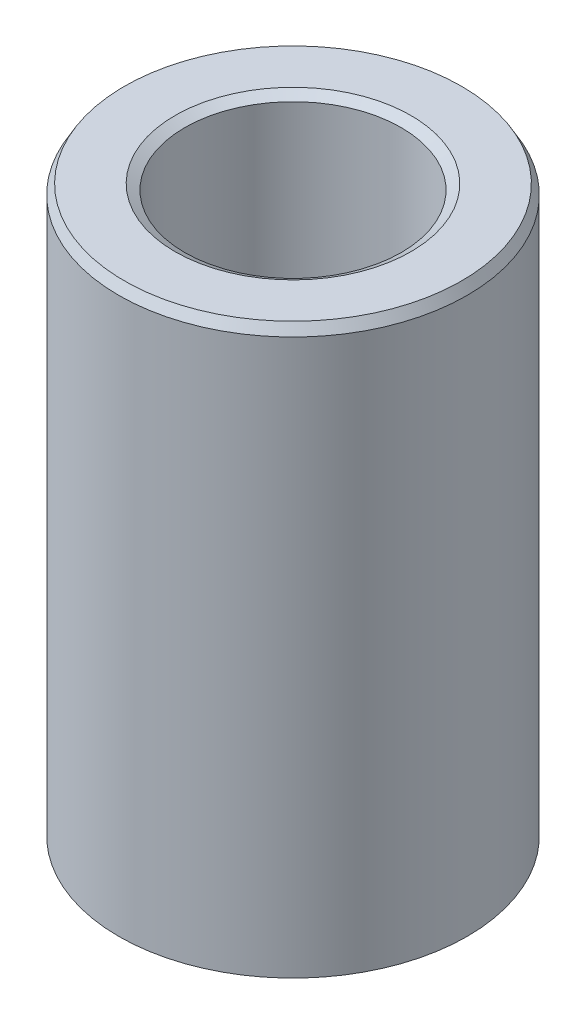
ISO-10303-21;
HEADER;
FILE_DESCRIPTION(('STEP AP214'),'2;1');
FILE_NAME('part.step','',(''),(''),'','','');
FILE_SCHEMA(('AUTOMOTIVE_DESIGN { 1 0 10303 214 1 1 1 1 }'));
ENDSEC;
DATA;
#1=APPLICATION_CONTEXT('core data for automotive mechanical design processes');
#2=APPLICATION_PROTOCOL_DEFINITION('international standard','automotive_design',2000,#1);
#3=PRODUCT_CONTEXT('',#1,'mechanical');
#4=PRODUCT('Part','Part','',(#3));
#5=PRODUCT_RELATED_PRODUCT_CATEGORY('part','',(#4));
#6=PRODUCT_DEFINITION_FORMATION('','',#4);
#7=PRODUCT_DEFINITION_CONTEXT('part definition',#1,'design');
#8=PRODUCT_DEFINITION('design','',#6,#7);
#9=PRODUCT_DEFINITION_SHAPE('','',#8);
#10=(LENGTH_UNIT() NAMED_UNIT(*) SI_UNIT(.MILLI.,.METRE.));
#11=(NAMED_UNIT(*) PLANE_ANGLE_UNIT() SI_UNIT($,.RADIAN.));
#12=(NAMED_UNIT(*) SI_UNIT($,.STERADIAN.) SOLID_ANGLE_UNIT());
#13=UNCERTAINTY_MEASURE_WITH_UNIT(LENGTH_MEASURE(1.E-05),#10,'distance_accuracy_value','');
#14=(GEOMETRIC_REPRESENTATION_CONTEXT(3) GLOBAL_UNCERTAINTY_ASSIGNED_CONTEXT((#13)) GLOBAL_UNIT_ASSIGNED_CONTEXT((#10,
#11,#12)) REPRESENTATION_CONTEXT('',''));
#15=CARTESIAN_POINT('',(0.,0.,0.));
#16=DIRECTION('',(0.,0.,1.));
#17=DIRECTION('',(1.,0.,0.));
#18=AXIS2_PLACEMENT_3D('',#15,#16,#17);
#19=CARTESIAN_POINT('',(0.,73.6859541370206,0.));
#20=DIRECTION('',(0.,-1.,0.));
#21=DIRECTION('',(0.,0.,-1.));
#22=AXIS2_PLACEMENT_3D('',#19,#20,#21);
#23=CYLINDRICAL_SURFACE('',#22,22.5);
#24=CARTESIAN_POINT('',(0.,0.725080795230634,0.));
#25=DIRECTION('',(0.,1.,0.));
#26=DIRECTION('',(0.,0.,1.));
#27=AXIS2_PLACEMENT_3D('',#24,#25,#26);
#28=CIRCLE('',#27,22.5);
#29=CARTESIAN_POINT('',(0.,0.725080795230634,22.5));
#30=VERTEX_POINT('',#29);
#31=EDGE_CURVE('E10',#30,#30,#28,.T.);
#32=ORIENTED_EDGE('',*,*,#31,.T.);
#33=EDGE_LOOP('',(#32));
#34=FACE_BOUND('',#33,.T.);
#35=CARTESIAN_POINT('',(0.,72.4300773600887,0.));
#36=DIRECTION('',(0.,1.,0.));
#37=DIRECTION('',(0.,0.,1.));
#38=AXIS2_PLACEMENT_3D('',#35,#36,#37);
#39=CIRCLE('',#38,22.5);
#40=CARTESIAN_POINT('',(0.,72.4300773600886,-22.5));
#41=VERTEX_POINT('',#40);
#42=EDGE_CURVE('E50',#41,#41,#39,.F.);
#43=ORIENTED_EDGE('',*,*,#42,.T.);
#44=EDGE_LOOP('',(#43));
#45=FACE_BOUND('',#44,.T.);
#46=ADVANCED_FACE('F39',(#34,#45),#23,.T.);
#47=CARTESIAN_POINT('',(0.,73.6859541370206,0.));
#48=DIRECTION('',(0.,1.,0.));
#49=DIRECTION('',(0.,0.,1.));
#50=AXIS2_PLACEMENT_3D('',#47,#48,#49);
#51=PLANE('',#50);
#52=CARTESIAN_POINT('',(0.,73.6859541370206,0.));
#53=DIRECTION('',(0.,1.,0.));
#54=DIRECTION('',(0.,0.,1.));
#55=AXIS2_PLACEMENT_3D('',#52,#53,#54);
#56=CIRCLE('',#55,15.2375210114344);
#57=CARTESIAN_POINT('',(0.,73.6859541370206,15.2375210114344));
#58=VERTEX_POINT('',#57);
#59=EDGE_CURVE('E58',#58,#58,#56,.F.);
#60=ORIENTED_EDGE('',*,*,#59,.T.);
#61=EDGE_LOOP('',(#60));
#62=FACE_BOUND('',#61,.T.);
#63=CARTESIAN_POINT('',(0.,73.6859541370206,0.));
#64=DIRECTION('',(0.,1.,0.));
#65=DIRECTION('',(0.,0.,1.));
#66=AXIS2_PLACEMENT_3D('',#63,#64,#65);
#67=CIRCLE('',#66,21.7749192047693);
#68=CARTESIAN_POINT('',(0.,73.6859541370206,-21.7749192047693));
#69=VERTEX_POINT('',#68);
#70=EDGE_CURVE('E61',#69,#69,#67,.T.);
#71=ORIENTED_EDGE('',*,*,#70,.T.);
#72=EDGE_LOOP('',(#71));
#73=FACE_BOUND('',#72,.T.);
#74=ADVANCED_FACE('F88',(#62,#73),#51,.T.);
#75=CARTESIAN_POINT('',(0.,0.,0.));
#76=DIRECTION('',(0.,1.,0.));
#77=DIRECTION('',(0.,0.,1.));
#78=AXIS2_PLACEMENT_3D('',#75,#76,#77);
#79=PLANE('',#78);
#80=CARTESIAN_POINT('',(0.,0.,0.));
#81=DIRECTION('',(0.,1.,0.));
#82=DIRECTION('',(0.,0.,1.));
#83=AXIS2_PLACEMENT_3D('',#80,#81,#82);
#84=CIRCLE('',#83,14.7067250297331);
#85=CARTESIAN_POINT('',(0.,0.,-14.7067250297331));
#86=VERTEX_POINT('',#85);
#87=EDGE_CURVE('E51',#86,#86,#84,.T.);
#88=ORIENTED_EDGE('',*,*,#87,.T.);
#89=EDGE_LOOP('',(#88));
#90=FACE_BOUND('',#89,.T.);
#91=CARTESIAN_POINT('',(0.,0.,0.));
#92=DIRECTION('',(0.,1.,0.));
#93=DIRECTION('',(0.,0.,1.));
#94=AXIS2_PLACEMENT_3D('',#91,#92,#93);
#95=CIRCLE('',#94,21.2441232230681);
#96=CARTESIAN_POINT('',(0.,0.,21.2441232230681));
#97=VERTEX_POINT('',#96);
#98=EDGE_CURVE('E54',#97,#97,#95,.F.);
#99=ORIENTED_EDGE('',*,*,#98,.T.);
#100=EDGE_LOOP('',(#99));
#101=FACE_BOUND('',#100,.T.);
#102=ADVANCED_FACE('F83',(#90,#101),#79,.F.);
#103=CARTESIAN_POINT('',(0.,73.6859541370206,0.));
#104=DIRECTION('',(0.,-1.,0.));
#105=DIRECTION('',(0.,0.,-1.));
#106=AXIS2_PLACEMENT_3D('',#103,#104,#105);
#107=CYLINDRICAL_SURFACE('',#106,13.9816442345025);
#108=CARTESIAN_POINT('',(0.,72.9608733417899,0.));
#109=DIRECTION('',(0.,1.,0.));
#110=DIRECTION('',(0.,0.,1.));
#111=AXIS2_PLACEMENT_3D('',#108,#109,#110);
#112=CIRCLE('',#111,13.9816442345025);
#113=CARTESIAN_POINT('',(0.,72.9608733417899,13.9816442345025));
#114=VERTEX_POINT('',#113);
#115=EDGE_CURVE('E67',#114,#114,#112,.T.);
#116=ORIENTED_EDGE('',*,*,#115,.T.);
#117=EDGE_LOOP('',(#116));
#118=FACE_BOUND('',#117,.T.);
#119=CARTESIAN_POINT('',(0.,1.25587677693194,0.));
#120=DIRECTION('',(0.,1.,0.));
#121=DIRECTION('',(0.,0.,1.));
#122=AXIS2_PLACEMENT_3D('',#119,#120,#121);
#123=CIRCLE('',#122,13.9816442345025);
#124=CARTESIAN_POINT('',(0.,1.25587677693194,-13.9816442345025));
#125=VERTEX_POINT('',#124);
#126=EDGE_CURVE('E69',#125,#125,#123,.F.);
#127=ORIENTED_EDGE('',*,*,#126,.T.);
#128=EDGE_LOOP('',(#127));
#129=FACE_BOUND('',#128,.T.);
#130=ADVANCED_FACE('F71',(#118,#129),#107,.F.);
#131=CARTESIAN_POINT('',(0.,72.9608733417899,0.));
#132=DIRECTION('',(0.,1.,0.));
#133=DIRECTION('',(0.,0.,1.));
#134=AXIS2_PLACEMENT_3D('',#131,#132,#133);
#135=CONICAL_SURFACE('',#134,13.9816442345025,1.0471975511966);
#136=ORIENTED_EDGE('',*,*,#59,.F.);
#137=EDGE_LOOP('',(#136));
#138=FACE_BOUND('',#137,.T.);
#139=ORIENTED_EDGE('',*,*,#115,.F.);
#140=EDGE_LOOP('',(#139));
#141=FACE_BOUND('',#140,.T.);
#142=ADVANCED_FACE('F77',(#138,#141),#135,.F.);
#143=CARTESIAN_POINT('',(0.,0.,0.));
#144=DIRECTION('',(0.,-1.,0.));
#145=DIRECTION('',(0.,0.,-1.));
#146=AXIS2_PLACEMENT_3D('',#143,#144,#145);
#147=CONICAL_SURFACE('',#146,14.7067250297331,0.523598775598295);
#148=CARTESIAN_POINT('',(0.,1.25587677693194,-13.9816442345025));
#149=CARTESIAN_POINT('',(0.,1.24279472717223,-13.9891971594528));
#150=CARTESIAN_POINT('',(0.,1.22971267741252,-13.9967500844031));
#151=CARTESIAN_POINT('',(0.,1.20354857789311,-14.0118559343037));
#152=CARTESIAN_POINT('',(0.,1.1904665281334,-14.019408859254));
#153=CARTESIAN_POINT('',(0.,1.16430242861398,-14.0345147091547));
#154=CARTESIAN_POINT('',(0.,1.15122037885428,-14.042067634105));
#155=CARTESIAN_POINT('',(0.,1.12505627933486,-14.0571734840056));
#156=CARTESIAN_POINT('',(0.,1.11197422957515,-14.064726408956));
#157=CARTESIAN_POINT('',(0.,1.08581013005574,-14.0798322588566));
#158=CARTESIAN_POINT('',(0.,1.07272808029603,-14.0873851838069));
#159=CARTESIAN_POINT('',(0.,1.04656398077662,-14.1024910337076));
#160=CARTESIAN_POINT('',(0.,1.03348193101691,-14.1100439586579));
#161=CARTESIAN_POINT('',(0.,1.00731783149749,-14.1251498085585));
#162=CARTESIAN_POINT('',(0.,0.994235781737784,-14.1327027335088));
#163=CARTESIAN_POINT('',(0.,0.968071682218369,-14.1478085834095));
#164=CARTESIAN_POINT('',(0.,0.954989632458661,-14.1553615083598));
#165=CARTESIAN_POINT('',(0.,0.928825532939246,-14.1704673582604));
#166=CARTESIAN_POINT('',(0.,0.915743483179538,-14.1780202832108));
#167=CARTESIAN_POINT('',(0.,0.889579383660123,-14.1931261331114));
#168=CARTESIAN_POINT('',(0.,0.876497333900415,-14.2006790580617));
#169=CARTESIAN_POINT('',(0.,0.850333234381,-14.2157849079623));
#170=CARTESIAN_POINT('',(0.,0.837251184621292,-14.2233378329127));
#171=CARTESIAN_POINT('',(0.,0.811087085101877,-14.2384436828133));
#172=CARTESIAN_POINT('',(0.,0.798005035342169,-14.2459966077636));
#173=CARTESIAN_POINT('',(0.,0.771840935822754,-14.2611024576643));
#174=CARTESIAN_POINT('',(0.,0.758758886063046,-14.2686553826146));
#175=CARTESIAN_POINT('',(0.,0.732594786543631,-14.2837612325152));
#176=CARTESIAN_POINT('',(0.,0.719512736783923,-14.2913141574655));
#177=CARTESIAN_POINT('',(0.,0.693348637264508,-14.3064200073662));
#178=CARTESIAN_POINT('',(0.,0.6802665875048,-14.3139729323165));
#179=CARTESIAN_POINT('',(0.,0.654102487985385,-14.3290787822171));
#180=CARTESIAN_POINT('',(0.,0.641020438225677,-14.3366317071675));
#181=CARTESIAN_POINT('',(0.,0.614856338706261,-14.3517375570681));
#182=CARTESIAN_POINT('',(0.,0.601774288946554,-14.3592904820184));
#183=CARTESIAN_POINT('',(0.,0.575610189427138,-14.3743963319191));
#184=CARTESIAN_POINT('',(0.,0.562528139667431,-14.3819492568694));
#185=CARTESIAN_POINT('',(0.,0.536364040148015,-14.39705510677));
#186=CARTESIAN_POINT('',(0.,0.523281990388308,-14.4046080317203));
#187=CARTESIAN_POINT('',(0.,0.497117890868892,-14.419713881621));
#188=CARTESIAN_POINT('',(0.,0.484035841109185,-14.4272668065713));
#189=CARTESIAN_POINT('',(0.,0.457871741589769,-14.4423726564719));
#190=CARTESIAN_POINT('',(0.,0.444789691830061,-14.4499255814222));
#191=CARTESIAN_POINT('',(0.,0.418625592310646,-14.4650314313229));
#192=CARTESIAN_POINT('',(0.,0.405543542550938,-14.4725843562732));
#193=CARTESIAN_POINT('',(0.,0.379379443031523,-14.4876902061738));
#194=CARTESIAN_POINT('',(0.,0.366297393271815,-14.4952431311242));
#195=CARTESIAN_POINT('',(0.,0.3401332937524,-14.5103489810248));
#196=CARTESIAN_POINT('',(0.,0.327051243992692,-14.5179019059751));
#197=CARTESIAN_POINT('',(0.,0.300887144473277,-14.5330077558758));
#198=CARTESIAN_POINT('',(0.,0.287805094713569,-14.5405606808261));
#199=CARTESIAN_POINT('',(0.,0.261640995194154,-14.5556665307267));
#200=CARTESIAN_POINT('',(0.,0.248558945434446,-14.563219455677));
#201=CARTESIAN_POINT('',(0.,0.222394845915031,-14.5783253055777));
#202=CARTESIAN_POINT('',(0.,0.209312796155323,-14.585878230528));
#203=CARTESIAN_POINT('',(0.,0.183148696635908,-14.6009840804286));
#204=CARTESIAN_POINT('',(0.,0.1700666468762,-14.608537005379));
#205=CARTESIAN_POINT('',(0.,0.143902547356785,-14.6236428552796));
#206=CARTESIAN_POINT('',(0.,0.130820497597077,-14.6311957802299));
#207=CARTESIAN_POINT('',(0.,0.104656398077662,-14.6463016301305));
#208=CARTESIAN_POINT('',(0.,0.0915743483179538,-14.6538545550809));
#209=CARTESIAN_POINT('',(0.,0.0654102487985384,-14.6689604049815));
#210=CARTESIAN_POINT('',(0.,0.0523281990388308,-14.6765133299318));
#211=CARTESIAN_POINT('',(0.,0.0261640995194154,-14.6916191798325));
#212=CARTESIAN_POINT('',(0.,0.0130820497597077,-14.6991721047828));
#213=CARTESIAN_POINT('',(0.,0.,-14.7067250297331));
#214=B_SPLINE_CURVE_WITH_KNOTS('',3,(#148,#149,#150,#151,#152,#153,#154,#155,#156,#157,#158,
#159,#160,#161,#162,#163,#164,#165,#166,#167,#168,#169,#170,#171,#172,#173,#174,#175,#176,#177,
#178,#179,#180,#181,#182,#183,#184,#185,#186,#187,#188,#189,#190,#191,#192,#193,#194,#195,#196,
#197,#198,#199,#200,#201,#202,#203,#204,#205,#206,#207,#208,#209,#210,#211,#212,#213),
.UNSPECIFIED.,.F.,.F.,(4,2,2,2,2,2,2,2,2,2,2,2,2,2,2,2,2,2,2,2,2,2,2,2,2,2,2,2,2,2,2,2,4),(0.,
0.0453175497019158,0.0906350994038316,0.135952649105747,0.181270198807663,0.226587748509579,
0.271905298211495,0.317222847913411,0.362540397615326,0.407857947317242,0.453175497019158,
0.498493046721074,0.543810596422989,0.589128146124905,0.634445695826821,0.679763245528737,
0.725080795230653,0.770398344932569,0.815715894634484,0.8610334443364,0.906350994038316,
0.951668543740232,0.996986093442148,1.04230364314406,1.08762119284598,1.13293874254789,
1.17825629224981,1.22357384195173,1.26889139165364,1.31420894135556,1.35952649105747,
1.40484404075939,1.4501615904613),.UNSPECIFIED.);
#215=EDGE_CURVE('BSEAM73',#125,#86,#214,.T.);
#216=ORIENTED_EDGE('',*,*,#126,.F.);
#217=ORIENTED_EDGE('',*,*,#87,.F.);
#218=ORIENTED_EDGE('',*,*,#215,.T.);
#219=ORIENTED_EDGE('',*,*,#215,.F.);
#220=EDGE_LOOP('',(#216,#218,#217,#219));
#221=FACE_BOUND('',#220,.T.);
#222=ADVANCED_FACE('F73',(#221),#147,.F.);
#223=CARTESIAN_POINT('',(0.,0.725080795230634,0.));
#224=DIRECTION('',(0.,1.,0.));
#225=DIRECTION('',(0.,0.,1.));
#226=AXIS2_PLACEMENT_3D('',#223,#224,#225);
#227=CONICAL_SURFACE('',#226,22.5,1.0471975511966);
#228=ORIENTED_EDGE('',*,*,#98,.F.);
#229=EDGE_LOOP('',(#228));
#230=FACE_BOUND('',#229,.T.);
#231=ORIENTED_EDGE('',*,*,#31,.F.);
#232=EDGE_LOOP('',(#231));
#233=FACE_BOUND('',#232,.T.);
#234=ADVANCED_FACE('F76',(#230,#233),#227,.T.);
#235=CARTESIAN_POINT('',(0.,73.6859541370206,0.));
#236=DIRECTION('',(0.,-1.,0.));
#237=DIRECTION('',(0.,0.,-1.));
#238=AXIS2_PLACEMENT_3D('',#235,#236,#237);
#239=CONICAL_SURFACE('',#238,21.7749192047693,0.523598775598301);
#240=CARTESIAN_POINT('',(0.,72.4300773600886,-22.5));
#241=CARTESIAN_POINT('',(0.,72.4431594098484,-22.4924470750497));
#242=CARTESIAN_POINT('',(0.,72.4562414596081,-22.4848941500994));
#243=CARTESIAN_POINT('',(0.,72.4824055591275,-22.4697883001987));
#244=CARTESIAN_POINT('',(0.,72.4954876088872,-22.4622353752484));
#245=CARTESIAN_POINT('',(0.,72.5216517084066,-22.4471295253478));
#246=CARTESIAN_POINT('',(0.,72.5347337581663,-22.4395766003975));
#247=CARTESIAN_POINT('',(0.,72.5608978576857,-22.4244707504968));
#248=CARTESIAN_POINT('',(0.,72.5739799074454,-22.4169178255465));
#249=CARTESIAN_POINT('',(0.,72.6001440069649,-22.4018119756459));
#250=CARTESIAN_POINT('',(0.,72.6132260567246,-22.3942590506955));
#251=CARTESIAN_POINT('',(0.,72.639390156244,-22.3791532007949));
#252=CARTESIAN_POINT('',(0.,72.6524722060037,-22.3716002758446));
#253=CARTESIAN_POINT('',(0.,72.6786363055231,-22.3564944259439));
#254=CARTESIAN_POINT('',(0.,72.6917183552828,-22.3489415009936));
#255=CARTESIAN_POINT('',(0.,72.7178824548022,-22.333835651093));
#256=CARTESIAN_POINT('',(0.,72.7309645045619,-22.3262827261427));
#257=CARTESIAN_POINT('',(0.,72.7571286040813,-22.311176876242));
#258=CARTESIAN_POINT('',(0.,72.770210653841,-22.3036239512917));
#259=CARTESIAN_POINT('',(0.,72.7963747533605,-22.2885181013911));
#260=CARTESIAN_POINT('',(0.,72.8094568031202,-22.2809651764407));
#261=CARTESIAN_POINT('',(0.,72.8356209026396,-22.2658593265401));
#262=CARTESIAN_POINT('',(0.,72.8487029523993,-22.2583064015898));
#263=CARTESIAN_POINT('',(0.,72.8748670519187,-22.2432005516891));
#264=CARTESIAN_POINT('',(0.,72.8879491016784,-22.2356476267388));
#265=CARTESIAN_POINT('',(0.,72.9141132011978,-22.2205417768382));
#266=CARTESIAN_POINT('',(0.,72.9271952509576,-22.2129888518879));
#267=CARTESIAN_POINT('',(0.,72.953359350477,-22.1978830019872));
#268=CARTESIAN_POINT('',(0.,72.9664414002367,-22.1903300770369));
#269=CARTESIAN_POINT('',(0.,72.9926054997561,-22.1752242271363));
#270=CARTESIAN_POINT('',(0.,73.0056875495158,-22.167671302186));
#271=CARTESIAN_POINT('',(0.,73.0318516490352,-22.1525654522853));
#272=CARTESIAN_POINT('',(0.,73.0449336987949,-22.145012527335));
#273=CARTESIAN_POINT('',(0.,73.0710977983143,-22.1299066774344));
#274=CARTESIAN_POINT('',(0.,73.084179848074,-22.122353752484));
#275=CARTESIAN_POINT('',(0.,73.1103439475934,-22.1072479025834));
#276=CARTESIAN_POINT('',(0.,73.1234259973532,-22.0996949776331));
#277=CARTESIAN_POINT('',(0.,73.1495900968726,-22.0845891277324));
#278=CARTESIAN_POINT('',(0.,73.1626721466323,-22.0770362027821));
#279=CARTESIAN_POINT('',(0.,73.1888362461517,-22.0619303528815));
#280=CARTESIAN_POINT('',(0.,73.2019182959114,-22.0543774279312));
#281=CARTESIAN_POINT('',(0.,73.2280823954308,-22.0392715780305));
#282=CARTESIAN_POINT('',(0.,73.2411644451905,-22.0317186530802));
#283=CARTESIAN_POINT('',(0.,73.26732854471,-22.0166128031796));
#284=CARTESIAN_POINT('',(0.,73.2804105944697,-22.0090598782292));
#285=CARTESIAN_POINT('',(0.,73.3065746939891,-21.9939540283286));
#286=CARTESIAN_POINT('',(0.,73.3196567437488,-21.9864011033783));
#287=CARTESIAN_POINT('',(0.,73.3458208432682,-21.9712952534777));
#288=CARTESIAN_POINT('',(0.,73.3589028930279,-21.9637423285273));
#289=CARTESIAN_POINT('',(0.,73.3850669925473,-21.9486364786267));
#290=CARTESIAN_POINT('',(0.,73.398149042307,-21.9410835536764));
#291=CARTESIAN_POINT('',(0.,73.4243131418264,-21.9259777037757));
#292=CARTESIAN_POINT('',(0.,73.4373951915861,-21.9184247788254));
#293=CARTESIAN_POINT('',(0.,73.4635592911056,-21.9033189289248));
#294=CARTESIAN_POINT('',(0.,73.4766413408653,-21.8957660039745));
#295=CARTESIAN_POINT('',(0.,73.5028054403847,-21.8806601540738));
#296=CARTESIAN_POINT('',(0.,73.5158874901444,-21.8731072291235));
#297=CARTESIAN_POINT('',(0.,73.5420515896638,-21.8580013792229));
#298=CARTESIAN_POINT('',(0.,73.5551336394235,-21.8504484542725));
#299=CARTESIAN_POINT('',(0.,73.5812977389429,-21.8353426043719));
#300=CARTESIAN_POINT('',(0.,73.5943797887026,-21.8277896794216));
#301=CARTESIAN_POINT('',(0.,73.6205438882221,-21.8126838295209));
#302=CARTESIAN_POINT('',(0.,73.6336259379818,-21.8051309045706));
#303=CARTESIAN_POINT('',(0.,73.6597900375012,-21.79002505467));
#304=CARTESIAN_POINT('',(0.,73.6728720872609,-21.7824721297197));
#305=CARTESIAN_POINT('',(0.,73.6859541370206,-21.7749192047693));
#306=B_SPLINE_CURVE_WITH_KNOTS('',3,(#240,#241,#242,#243,#244,#245,#246,#247,#248,#249,#250,
#251,#252,#253,#254,#255,#256,#257,#258,#259,#260,#261,#262,#263,#264,#265,#266,#267,#268,#269,
#270,#271,#272,#273,#274,#275,#276,#277,#278,#279,#280,#281,#282,#283,#284,#285,#286,#287,#288,
#289,#290,#291,#292,#293,#294,#295,#296,#297,#298,#299,#300,#301,#302,#303,#304,#305),
.UNSPECIFIED.,.F.,.F.,(4,2,2,2,2,2,2,2,2,2,2,2,2,2,2,2,2,2,2,2,2,2,2,2,2,2,2,2,2,2,2,2,4),(0.,
0.0453175497019153,0.0906350994038323,0.135952649105749,0.181270198807665,0.226587748509582,
0.271905298211497,0.317222847913414,0.362540397615331,0.407857947317246,0.453175497019163,
0.498493046721079,0.543810596422996,0.589128146124913,0.634445695826828,0.679763245528745,
0.72508079523066,0.770398344932577,0.815715894634493,0.86103344433641,0.906350994038327,
0.951668543740242,0.996986093442159,1.04230364314407,1.08762119284599,1.13293874254791,
1.17825629224982,1.22357384195174,1.26889139165366,1.31420894135557,1.35952649105749,
1.40484404075941,1.45016159046132),.UNSPECIFIED.);
#307=EDGE_CURVE('BSEAM45',#41,#69,#306,.T.);
#308=ORIENTED_EDGE('',*,*,#42,.F.);
#309=ORIENTED_EDGE('',*,*,#70,.F.);
#310=ORIENTED_EDGE('',*,*,#307,.T.);
#311=ORIENTED_EDGE('',*,*,#307,.F.);
#312=EDGE_LOOP('',(#308,#310,#309,#311));
#313=FACE_BOUND('',#312,.T.);
#314=ADVANCED_FACE('F45',(#313),#239,.T.);
#315=CLOSED_SHELL('',(#46,#74,#102,#130,#142,#222,#234,#314));
#316=MANIFOLD_SOLID_BREP('B2',#315);
#317=ADVANCED_BREP_SHAPE_REPRESENTATION('',(#18,#316),#14);
#318=SHAPE_DEFINITION_REPRESENTATION(#9,#317);
ENDSEC;
END-ISO-10303-21;
